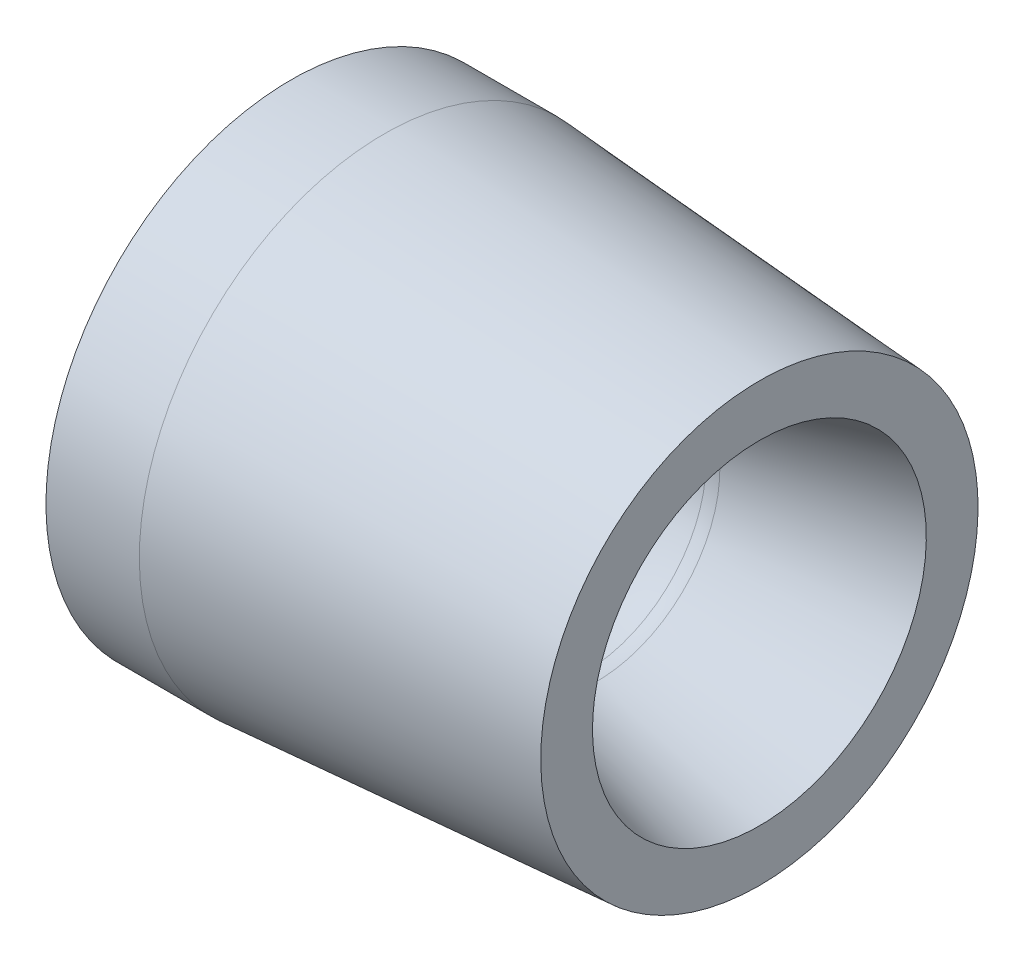
ISO-10303-21;
HEADER;
FILE_DESCRIPTION(('STEP AP214'),'2;1');
FILE_NAME('part.step','',(''),(''),'','','');
FILE_SCHEMA(('AUTOMOTIVE_DESIGN { 1 0 10303 214 1 1 1 1 }'));
ENDSEC;
DATA;
#1=APPLICATION_CONTEXT('core data for automotive mechanical design processes');
#2=APPLICATION_PROTOCOL_DEFINITION('international standard','automotive_design',2000,#1);
#3=PRODUCT_CONTEXT('',#1,'mechanical');
#4=PRODUCT('Part','Part','',(#3));
#5=PRODUCT_RELATED_PRODUCT_CATEGORY('part','',(#4));
#6=PRODUCT_DEFINITION_FORMATION('','',#4);
#7=PRODUCT_DEFINITION_CONTEXT('part definition',#1,'design');
#8=PRODUCT_DEFINITION('design','',#6,#7);
#9=PRODUCT_DEFINITION_SHAPE('','',#8);
#10=(LENGTH_UNIT() NAMED_UNIT(*) SI_UNIT(.MILLI.,.METRE.));
#11=(NAMED_UNIT(*) PLANE_ANGLE_UNIT() SI_UNIT($,.RADIAN.));
#12=(NAMED_UNIT(*) SI_UNIT($,.STERADIAN.) SOLID_ANGLE_UNIT());
#13=UNCERTAINTY_MEASURE_WITH_UNIT(LENGTH_MEASURE(1.E-05),#10,'distance_accuracy_value','');
#14=(GEOMETRIC_REPRESENTATION_CONTEXT(3) GLOBAL_UNCERTAINTY_ASSIGNED_CONTEXT((#13)) GLOBAL_UNIT_ASSIGNED_CONTEXT((#10,
#11,#12)) REPRESENTATION_CONTEXT('',''));
#15=CARTESIAN_POINT('',(0.,0.,0.));
#16=DIRECTION('',(0.,0.,1.));
#17=DIRECTION('',(1.,0.,0.));
#18=AXIS2_PLACEMENT_3D('',#15,#16,#17);
#19=CARTESIAN_POINT('',(1.78084856857237,0.,0.));
#20=DIRECTION('',(1.,0.,0.));
#21=DIRECTION('',(0.,1.,0.));
#22=AXIS2_PLACEMENT_3D('',#19,#20,#21);
#23=CONICAL_SURFACE('',#22,17.8882556763971,0.262685253079923);
#24=CARTESIAN_POINT('',(1.78084856857237,0.,0.));
#25=DIRECTION('',(1.,0.,0.));
#26=DIRECTION('',(0.,1.,0.));
#27=AXIS2_PLACEMENT_3D('',#24,#25,#26);
#28=CIRCLE('',#27,17.8882556763971);
#29=CARTESIAN_POINT('',(1.78084856857237,17.8882556763971,0.));
#30=VERTEX_POINT('',#29);
#31=EDGE_CURVE('E42',#30,#30,#28,.T.);
#32=ORIENTED_EDGE('',*,*,#31,.F.);
#33=EDGE_LOOP('',(#32));
#34=FACE_BOUND('',#33,.T.);
#35=CARTESIAN_POINT('',(25.4,0.,0.));
#36=DIRECTION('',(1.,0.,0.));
#37=DIRECTION('',(0.,1.,0.));
#38=AXIS2_PLACEMENT_3D('',#35,#36,#37);
#39=CIRCLE('',#38,24.2394191763448);
#40=CARTESIAN_POINT('',(25.4,24.2394191763448,0.));
#41=VERTEX_POINT('',#40);
#42=EDGE_CURVE('E38',#41,#41,#39,.T.);
#43=ORIENTED_EDGE('',*,*,#42,.T.);
#44=EDGE_LOOP('',(#43));
#45=FACE_BOUND('',#44,.T.);
#46=ADVANCED_FACE('F34',(#34,#45),#23,.F.);
#47=CARTESIAN_POINT('',(-59.69,0.,0.));
#48=DIRECTION('',(-1.,0.,0.));
#49=DIRECTION('',(0.,-1.,0.));
#50=AXIS2_PLACEMENT_3D('',#47,#48,#49);
#51=CONICAL_SURFACE('',#50,38.1,0.356624235626495);
#52=CARTESIAN_POINT('',(-9.31084010694146,0.,0.));
#53=DIRECTION('',(1.,0.,0.));
#54=DIRECTION('',(0.,1.,0.));
#55=AXIS2_PLACEMENT_3D('',#52,#53,#54);
#56=CIRCLE('',#55,19.3310581686222);
#57=CARTESIAN_POINT('',(-9.31084010694146,19.3310581686222,0.));
#58=VERTEX_POINT('',#57);
#59=EDGE_CURVE('E46',#58,#58,#56,.T.);
#60=ORIENTED_EDGE('',*,*,#59,.T.);
#61=EDGE_LOOP('',(#60));
#62=FACE_BOUND('',#61,.T.);
#63=CARTESIAN_POINT('',(-42.6454767554289,0.,0.));
#64=DIRECTION('',(-1.,0.,0.));
#65=DIRECTION('',(0.,-1.,0.));
#66=AXIS2_PLACEMENT_3D('',#63,#64,#65);
#67=CIRCLE('',#66,31.75);
#68=CARTESIAN_POINT('',(-42.6454767554289,-31.75,0.));
#69=VERTEX_POINT('',#68);
#70=EDGE_CURVE('E51',#69,#69,#67,.T.);
#71=ORIENTED_EDGE('',*,*,#70,.T.);
#72=EDGE_LOOP('',(#71));
#73=FACE_BOUND('',#72,.T.);
#74=ADVANCED_FACE('F78',(#62,#73),#51,.F.);
#75=CARTESIAN_POINT('',(0.,0.,0.));
#76=DIRECTION('',(1.,0.,0.));
#77=DIRECTION('',(0.,1.,0.));
#78=AXIS2_PLACEMENT_3D('',#75,#76,#77);
#79=TOROIDAL_SURFACE('',#78,44.323,26.67);
#80=CARTESIAN_POINT('',(0.,0.,0.));
#81=DIRECTION('',(1.,0.,0.));
#82=DIRECTION('',(0.,1.,0.));
#83=AXIS2_PLACEMENT_3D('',#80,#81,#82);
#84=CIRCLE('',#83,17.653);
#85=CARTESIAN_POINT('',(0.,17.653,0.));
#86=VERTEX_POINT('',#85);
#87=EDGE_CURVE('E10',#86,#86,#84,.T.);
#88=ORIENTED_EDGE('',*,*,#87,.T.);
#89=EDGE_LOOP('',(#88));
#90=FACE_BOUND('',#89,.T.);
#91=ORIENTED_EDGE('',*,*,#59,.F.);
#92=EDGE_LOOP('',(#91));
#93=FACE_BOUND('',#92,.T.);
#94=ADVANCED_FACE('F36',(#90,#93),#79,.T.);
#95=CARTESIAN_POINT('',(0.,0.,0.));
#96=DIRECTION('',(1.,0.,0.));
#97=DIRECTION('',(0.,1.,0.));
#98=AXIS2_PLACEMENT_3D('',#95,#96,#97);
#99=TOROIDAL_SURFACE('',#98,24.511,6.858);
#100=ORIENTED_EDGE('',*,*,#31,.T.);
#101=EDGE_LOOP('',(#100));
#102=FACE_BOUND('',#101,.T.);
#103=ORIENTED_EDGE('',*,*,#87,.F.);
#104=EDGE_LOOP('',(#103));
#105=FACE_BOUND('',#104,.T.);
#106=ADVANCED_FACE('F89',(#102,#105),#99,.T.);
#107=CARTESIAN_POINT('',(-42.6454767554289,0.,0.));
#108=DIRECTION('',(-1.,0.,0.));
#109=DIRECTION('',(0.,-1.,0.));
#110=AXIS2_PLACEMENT_3D('',#107,#108,#109);
#111=PLANE('',#110);
#112=CARTESIAN_POINT('',(-42.6454767554289,0.,0.));
#113=DIRECTION('',(-1.,0.,0.));
#114=DIRECTION('',(0.,-1.,0.));
#115=AXIS2_PLACEMENT_3D('',#112,#113,#114);
#116=CIRCLE('',#115,35.56);
#117=CARTESIAN_POINT('',(-42.6454767554289,-35.56,0.));
#118=VERTEX_POINT('',#117);
#119=EDGE_CURVE('E54',#118,#118,#116,.T.);
#120=ORIENTED_EDGE('',*,*,#119,.T.);
#121=EDGE_LOOP('',(#120));
#122=FACE_BOUND('',#121,.T.);
#123=ORIENTED_EDGE('',*,*,#70,.F.);
#124=EDGE_LOOP('',(#123));
#125=FACE_BOUND('',#124,.T.);
#126=ADVANCED_FACE('F91',(#122,#125),#111,.T.);
#127=CARTESIAN_POINT('',(-50.8,0.,0.));
#128=DIRECTION('',(-1.,0.,0.));
#129=DIRECTION('',(0.,-1.,0.));
#130=AXIS2_PLACEMENT_3D('',#127,#128,#129);
#131=CYLINDRICAL_SURFACE('',#130,35.56);
#132=ORIENTED_EDGE('',*,*,#119,.F.);
#133=EDGE_LOOP('',(#132));
#134=FACE_BOUND('',#133,.T.);
#135=CARTESIAN_POINT('',(-29.085538438072,0.,0.));
#136=DIRECTION('',(-1.,0.,0.));
#137=DIRECTION('',(0.,-1.,0.));
#138=AXIS2_PLACEMENT_3D('',#135,#136,#137);
#139=CIRCLE('',#138,35.56);
#140=CARTESIAN_POINT('',(-29.085538438072,-35.56,0.));
#141=VERTEX_POINT('',#140);
#142=EDGE_CURVE('E57',#141,#141,#139,.T.);
#143=ORIENTED_EDGE('',*,*,#142,.T.);
#144=EDGE_LOOP('',(#143));
#145=FACE_BOUND('',#144,.T.);
#146=ADVANCED_FACE('F74',(#134,#145),#131,.T.);
#147=CARTESIAN_POINT('',(-29.085538438072,0.,0.));
#148=DIRECTION('',(-1.,0.,0.));
#149=DIRECTION('',(0.,-1.,0.));
#150=AXIS2_PLACEMENT_3D('',#147,#148,#149);
#151=CONICAL_SURFACE('',#150,35.56,0.0698131700797735);
#152=CARTESIAN_POINT('',(25.4,0.,0.));
#153=DIRECTION('',(-1.,0.,0.));
#154=DIRECTION('',(0.,-1.,0.));
#155=AXIS2_PLACEMENT_3D('',#152,#153,#154);
#156=CIRCLE('',#155,31.75);
#157=CARTESIAN_POINT('',(25.4,-31.75,0.));
#158=VERTEX_POINT('',#157);
#159=EDGE_CURVE('E60',#158,#158,#156,.T.);
#160=ORIENTED_EDGE('',*,*,#159,.T.);
#161=EDGE_LOOP('',(#160));
#162=FACE_BOUND('',#161,.T.);
#163=ORIENTED_EDGE('',*,*,#142,.F.);
#164=EDGE_LOOP('',(#163));
#165=FACE_BOUND('',#164,.T.);
#166=ADVANCED_FACE('F64',(#162,#165),#151,.T.);
#167=CARTESIAN_POINT('',(25.4,0.,0.));
#168=DIRECTION('',(1.,0.,0.));
#169=DIRECTION('',(0.,1.,0.));
#170=AXIS2_PLACEMENT_3D('',#167,#168,#169);
#171=PLANE('',#170);
#172=ORIENTED_EDGE('',*,*,#42,.F.);
#173=EDGE_LOOP('',(#172));
#174=FACE_BOUND('',#173,.T.);
#175=ORIENTED_EDGE('',*,*,#159,.F.);
#176=EDGE_LOOP('',(#175));
#177=FACE_BOUND('',#176,.T.);
#178=ADVANCED_FACE('F67',(#174,#177),#171,.T.);
#179=CLOSED_SHELL('',(#46,#74,#94,#106,#126,#146,#166,#178));
#180=MANIFOLD_SOLID_BREP('B2',#179);
#181=ADVANCED_BREP_SHAPE_REPRESENTATION('',(#18,#180),#14);
#182=SHAPE_DEFINITION_REPRESENTATION(#9,#181);
ENDSEC;
END-ISO-10303-21;
